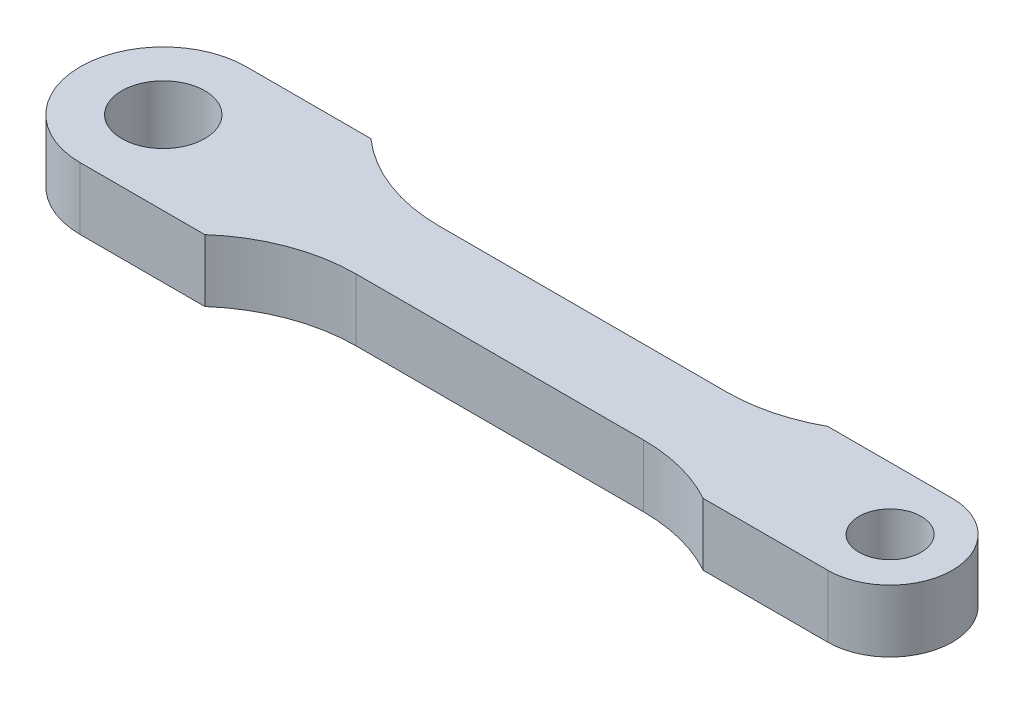
ISO-10303-21;
HEADER;
FILE_DESCRIPTION(('STEP AP214'),'2;1');
FILE_NAME('part.step','',(''),(''),'','','');
FILE_SCHEMA(('AUTOMOTIVE_DESIGN { 1 0 10303 214 1 1 1 1 }'));
ENDSEC;
DATA;
#1=APPLICATION_CONTEXT('core data for automotive mechanical design processes');
#2=APPLICATION_PROTOCOL_DEFINITION('international standard','automotive_design',2000,#1);
#3=PRODUCT_CONTEXT('',#1,'mechanical');
#4=PRODUCT('Part','Part','',(#3));
#5=PRODUCT_RELATED_PRODUCT_CATEGORY('part','',(#4));
#6=PRODUCT_DEFINITION_FORMATION('','',#4);
#7=PRODUCT_DEFINITION_CONTEXT('part definition',#1,'design');
#8=PRODUCT_DEFINITION('design','',#6,#7);
#9=PRODUCT_DEFINITION_SHAPE('','',#8);
#10=(LENGTH_UNIT() NAMED_UNIT(*) SI_UNIT(.MILLI.,.METRE.));
#11=(NAMED_UNIT(*) PLANE_ANGLE_UNIT() SI_UNIT($,.RADIAN.));
#12=(NAMED_UNIT(*) SI_UNIT($,.STERADIAN.) SOLID_ANGLE_UNIT());
#13=UNCERTAINTY_MEASURE_WITH_UNIT(LENGTH_MEASURE(1.E-05),#10,'distance_accuracy_value','');
#14=(GEOMETRIC_REPRESENTATION_CONTEXT(3) GLOBAL_UNCERTAINTY_ASSIGNED_CONTEXT((#13)) GLOBAL_UNIT_ASSIGNED_CONTEXT((#10,
#11,#12)) REPRESENTATION_CONTEXT('',''));
#15=CARTESIAN_POINT('',(0.,0.,0.));
#16=DIRECTION('',(0.,0.,1.));
#17=DIRECTION('',(1.,0.,0.));
#18=AXIS2_PLACEMENT_3D('',#15,#16,#17);
#19=CARTESIAN_POINT('',(0.,3.,-2.00000000000001));
#20=DIRECTION('',(0.,0.,-1.));
#21=DIRECTION('',(-1.,0.,0.));
#22=AXIS2_PLACEMENT_3D('',#19,#20,#21);
#23=PLANE('',#22);
#24=DIRECTION('',(1.,0.,0.));
#25=VECTOR('',#24,1.);
#26=CARTESIAN_POINT('',(0.,0.,-2.00000000000001));
#27=LINE('',#26,#25);
#28=CARTESIAN_POINT('',(11.2915026221292,0.,-2.00000000000001));
#29=VERTEX_POINT('',#28);
#30=CARTESIAN_POINT('',(25.1270166537926,0.,-2.00000000000001));
#31=VERTEX_POINT('',#30);
#32=EDGE_CURVE('E189',#29,#31,#27,.T.);
#33=ORIENTED_EDGE('',*,*,#32,.F.);
#34=DIRECTION('',(0.,-1.,0.));
#35=VECTOR('',#34,1.);
#36=CARTESIAN_POINT('',(11.2915026221292,3.,-2.00000000000001));
#37=LINE('',#36,#35);
#38=CARTESIAN_POINT('',(11.2915026221292,3.,-2.00000000000001));
#39=VERTEX_POINT('',#38);
#40=EDGE_CURVE('E11',#39,#29,#37,.T.);
#41=ORIENTED_EDGE('',*,*,#40,.F.);
#42=DIRECTION('',(1.,0.,0.));
#43=VECTOR('',#42,1.);
#44=CARTESIAN_POINT('',(0.,3.,-2.00000000000001));
#45=LINE('',#44,#43);
#46=CARTESIAN_POINT('',(25.1270166537926,3.,-2.00000000000001));
#47=VERTEX_POINT('',#46);
#48=EDGE_CURVE('E352',#39,#47,#45,.T.);
#49=ORIENTED_EDGE('',*,*,#48,.T.);
#50=DIRECTION('',(0.,-1.,0.));
#51=VECTOR('',#50,1.);
#52=CARTESIAN_POINT('',(25.1270166537926,3.,-2.00000000000001));
#53=LINE('',#52,#51);
#54=EDGE_CURVE('E104',#47,#31,#53,.T.);
#55=ORIENTED_EDGE('',*,*,#54,.T.);
#56=EDGE_LOOP('',(#33,#41,#49,#55));
#57=FACE_BOUND('',#56,.T.);
#58=ADVANCED_FACE('F41',(#57),#23,.T.);
#59=CARTESIAN_POINT('',(11.2915026221292,3.,-10.));
#60=DIRECTION('',(0.,-1.,0.));
#61=DIRECTION('',(0.,0.,-1.));
#62=AXIS2_PLACEMENT_3D('',#59,#60,#61);
#63=CYLINDRICAL_SURFACE('',#62,8.);
#64=CARTESIAN_POINT('',(11.2915026221292,0.,-10.));
#65=DIRECTION('',(0.,1.,0.));
#66=DIRECTION('',(0.,0.,1.));
#67=AXIS2_PLACEMENT_3D('',#64,#65,#66);
#68=CIRCLE('',#67,8.);
#69=CARTESIAN_POINT('',(6.,0.,-4.));
#70=VERTEX_POINT('',#69);
#71=EDGE_CURVE('E187',#29,#70,#68,.F.);
#72=ORIENTED_EDGE('',*,*,#71,.T.);
#73=DIRECTION('',(0.,-1.,0.));
#74=VECTOR('',#73,1.);
#75=CARTESIAN_POINT('',(6.,3.,-4.));
#76=LINE('',#75,#74);
#77=CARTESIAN_POINT('',(6.,3.,-4.));
#78=VERTEX_POINT('',#77);
#79=EDGE_CURVE('E50',#78,#70,#76,.T.);
#80=ORIENTED_EDGE('',*,*,#79,.F.);
#81=CARTESIAN_POINT('',(11.2915026221292,3.,-10.));
#82=DIRECTION('',(0.,1.,0.));
#83=DIRECTION('',(0.,0.,1.));
#84=AXIS2_PLACEMENT_3D('',#81,#82,#83);
#85=CIRCLE('',#84,8.);
#86=EDGE_CURVE('E350',#39,#78,#85,.F.);
#87=ORIENTED_EDGE('',*,*,#86,.F.);
#88=ORIENTED_EDGE('',*,*,#40,.T.);
#89=EDGE_LOOP('',(#72,#80,#87,#88));
#90=FACE_BOUND('',#89,.T.);
#91=ADVANCED_FACE('F188',(#90),#63,.F.);
#92=CARTESIAN_POINT('',(0.,3.,-4.));
#93=DIRECTION('',(0.,0.,-1.));
#94=DIRECTION('',(-1.,0.,0.));
#95=AXIS2_PLACEMENT_3D('',#92,#93,#94);
#96=PLANE('',#95);
#97=DIRECTION('',(1.,0.,0.));
#98=VECTOR('',#97,1.);
#99=CARTESIAN_POINT('',(0.,0.,-4.));
#100=LINE('',#99,#98);
#101=CARTESIAN_POINT('',(0.,0.,-4.));
#102=VERTEX_POINT('',#101);
#103=EDGE_CURVE('E182',#102,#70,#100,.T.);
#104=ORIENTED_EDGE('',*,*,#103,.F.);
#105=DIRECTION('',(0.,-1.,0.));
#106=VECTOR('',#105,1.);
#107=CARTESIAN_POINT('',(0.,3.,-4.));
#108=LINE('',#107,#106);
#109=CARTESIAN_POINT('',(0.,3.,-4.));
#110=VERTEX_POINT('',#109);
#111=EDGE_CURVE('E174',#110,#102,#108,.T.);
#112=ORIENTED_EDGE('',*,*,#111,.F.);
#113=DIRECTION('',(1.,0.,0.));
#114=VECTOR('',#113,1.);
#115=CARTESIAN_POINT('',(0.,3.,-4.));
#116=LINE('',#115,#114);
#117=EDGE_CURVE('E184',#110,#78,#116,.T.);
#118=ORIENTED_EDGE('',*,*,#117,.T.);
#119=ORIENTED_EDGE('',*,*,#79,.T.);
#120=EDGE_LOOP('',(#104,#112,#118,#119));
#121=FACE_BOUND('',#120,.T.);
#122=ADVANCED_FACE('F180',(#121),#96,.T.);
#123=CARTESIAN_POINT('',(0.,3.,0.));
#124=DIRECTION('',(0.,-1.,0.));
#125=DIRECTION('',(0.,0.,-1.));
#126=AXIS2_PLACEMENT_3D('',#123,#124,#125);
#127=CYLINDRICAL_SURFACE('',#126,4.);
#128=CARTESIAN_POINT('',(0.,0.,0.));
#129=DIRECTION('',(0.,1.,0.));
#130=DIRECTION('',(0.,0.,1.));
#131=AXIS2_PLACEMENT_3D('',#128,#129,#130);
#132=CIRCLE('',#131,4.);
#133=CARTESIAN_POINT('',(0.,0.,4.));
#134=VERTEX_POINT('',#133);
#135=EDGE_CURVE('E194',#102,#134,#132,.T.);
#136=ORIENTED_EDGE('',*,*,#135,.T.);
#137=DIRECTION('',(0.,-1.,0.));
#138=VECTOR('',#137,1.);
#139=CARTESIAN_POINT('',(0.,3.,4.));
#140=LINE('',#139,#138);
#141=CARTESIAN_POINT('',(0.,3.,4.));
#142=VERTEX_POINT('',#141);
#143=EDGE_CURVE('E171',#142,#134,#140,.T.);
#144=ORIENTED_EDGE('',*,*,#143,.F.);
#145=CARTESIAN_POINT('',(0.,3.,0.));
#146=DIRECTION('',(0.,1.,0.));
#147=DIRECTION('',(0.,0.,1.));
#148=AXIS2_PLACEMENT_3D('',#145,#146,#147);
#149=CIRCLE('',#148,4.);
#150=EDGE_CURVE('E347',#110,#142,#149,.T.);
#151=ORIENTED_EDGE('',*,*,#150,.F.);
#152=ORIENTED_EDGE('',*,*,#111,.T.);
#153=EDGE_LOOP('',(#136,#144,#151,#152));
#154=FACE_BOUND('',#153,.T.);
#155=ADVANCED_FACE('F281',(#154),#127,.T.);
#156=CARTESIAN_POINT('',(0.,3.,4.));
#157=DIRECTION('',(0.,0.,-1.));
#158=DIRECTION('',(-1.,0.,0.));
#159=AXIS2_PLACEMENT_3D('',#156,#157,#158);
#160=PLANE('',#159);
#161=DIRECTION('',(1.,0.,0.));
#162=VECTOR('',#161,1.);
#163=CARTESIAN_POINT('',(0.,0.,4.));
#164=LINE('',#163,#162);
#165=CARTESIAN_POINT('',(6.,0.,4.));
#166=VERTEX_POINT('',#165);
#167=EDGE_CURVE('E196',#134,#166,#164,.T.);
#168=ORIENTED_EDGE('',*,*,#167,.T.);
#169=DIRECTION('',(0.,-1.,0.));
#170=VECTOR('',#169,1.);
#171=CARTESIAN_POINT('',(6.,3.,4.));
#172=LINE('',#171,#170);
#173=CARTESIAN_POINT('',(6.,3.,4.));
#174=VERTEX_POINT('',#173);
#175=EDGE_CURVE('E169',#174,#166,#172,.T.);
#176=ORIENTED_EDGE('',*,*,#175,.F.);
#177=DIRECTION('',(1.,0.,0.));
#178=VECTOR('',#177,1.);
#179=CARTESIAN_POINT('',(0.,3.,4.));
#180=LINE('',#179,#178);
#181=EDGE_CURVE('E348',#142,#174,#180,.T.);
#182=ORIENTED_EDGE('',*,*,#181,.F.);
#183=ORIENTED_EDGE('',*,*,#143,.T.);
#184=EDGE_LOOP('',(#168,#176,#182,#183));
#185=FACE_BOUND('',#184,.T.);
#186=ADVANCED_FACE('F277',(#185),#160,.F.);
#187=CARTESIAN_POINT('',(11.2915026221292,3.,10.));
#188=DIRECTION('',(0.,-1.,0.));
#189=DIRECTION('',(0.,0.,-1.));
#190=AXIS2_PLACEMENT_3D('',#187,#188,#189);
#191=CYLINDRICAL_SURFACE('',#190,8.);
#192=CARTESIAN_POINT('',(11.2915026221292,0.,10.));
#193=DIRECTION('',(0.,1.,0.));
#194=DIRECTION('',(0.,0.,1.));
#195=AXIS2_PLACEMENT_3D('',#192,#193,#194);
#196=CIRCLE('',#195,8.);
#197=CARTESIAN_POINT('',(11.2915026221292,0.,2.00000000000001));
#198=VERTEX_POINT('',#197);
#199=EDGE_CURVE('E202',#198,#166,#196,.T.);
#200=ORIENTED_EDGE('',*,*,#199,.F.);
#201=DIRECTION('',(0.,-1.,0.));
#202=VECTOR('',#201,1.);
#203=CARTESIAN_POINT('',(11.2915026221292,3.,2.00000000000001));
#204=LINE('',#203,#202);
#205=CARTESIAN_POINT('',(11.2915026221292,3.,2.00000000000001));
#206=VERTEX_POINT('',#205);
#207=EDGE_CURVE('E167',#206,#198,#204,.T.);
#208=ORIENTED_EDGE('',*,*,#207,.F.);
#209=CARTESIAN_POINT('',(11.2915026221292,3.,10.));
#210=DIRECTION('',(0.,1.,0.));
#211=DIRECTION('',(0.,0.,1.));
#212=AXIS2_PLACEMENT_3D('',#209,#210,#211);
#213=CIRCLE('',#212,8.);
#214=EDGE_CURVE('E357',#206,#174,#213,.T.);
#215=ORIENTED_EDGE('',*,*,#214,.T.);
#216=ORIENTED_EDGE('',*,*,#175,.T.);
#217=EDGE_LOOP('',(#200,#208,#215,#216));
#218=FACE_BOUND('',#217,.T.);
#219=ADVANCED_FACE('F273',(#218),#191,.F.);
#220=CARTESIAN_POINT('',(0.,3.,2.00000000000001));
#221=DIRECTION('',(0.,0.,-1.));
#222=DIRECTION('',(-1.,0.,0.));
#223=AXIS2_PLACEMENT_3D('',#220,#221,#222);
#224=PLANE('',#223);
#225=DIRECTION('',(1.,0.,0.));
#226=VECTOR('',#225,1.);
#227=CARTESIAN_POINT('',(0.,0.,2.00000000000001));
#228=LINE('',#227,#226);
#229=CARTESIAN_POINT('',(25.1270166537926,0.,2.00000000000001));
#230=VERTEX_POINT('',#229);
#231=EDGE_CURVE('E205',#198,#230,#228,.T.);
#232=ORIENTED_EDGE('',*,*,#231,.T.);
#233=DIRECTION('',(0.,-1.,0.));
#234=VECTOR('',#233,1.);
#235=CARTESIAN_POINT('',(25.1270166537926,3.,2.00000000000001));
#236=LINE('',#235,#234);
#237=CARTESIAN_POINT('',(25.1270166537926,3.,2.00000000000001));
#238=VERTEX_POINT('',#237);
#239=EDGE_CURVE('E165',#238,#230,#236,.T.);
#240=ORIENTED_EDGE('',*,*,#239,.F.);
#241=DIRECTION('',(1.,0.,0.));
#242=VECTOR('',#241,1.);
#243=CARTESIAN_POINT('',(0.,3.,2.00000000000001));
#244=LINE('',#243,#242);
#245=EDGE_CURVE('E360',#206,#238,#244,.T.);
#246=ORIENTED_EDGE('',*,*,#245,.F.);
#247=ORIENTED_EDGE('',*,*,#207,.T.);
#248=EDGE_LOOP('',(#232,#240,#246,#247));
#249=FACE_BOUND('',#248,.T.);
#250=ADVANCED_FACE('F269',(#249),#224,.F.);
#251=CARTESIAN_POINT('',(25.1270166537926,3.,10.));
#252=DIRECTION('',(0.,-1.,0.));
#253=DIRECTION('',(0.,0.,-1.));
#254=AXIS2_PLACEMENT_3D('',#251,#252,#253);
#255=CYLINDRICAL_SURFACE('',#254,8.);
#256=CARTESIAN_POINT('',(25.1270166537926,0.,10.));
#257=DIRECTION('',(0.,1.,0.));
#258=DIRECTION('',(0.,0.,1.));
#259=AXIS2_PLACEMENT_3D('',#256,#257,#258);
#260=CIRCLE('',#259,8.);
#261=CARTESIAN_POINT('',(29.,0.,3.));
#262=VERTEX_POINT('',#261);
#263=EDGE_CURVE('E208',#262,#230,#260,.T.);
#264=ORIENTED_EDGE('',*,*,#263,.F.);
#265=DIRECTION('',(0.,-1.,0.));
#266=VECTOR('',#265,1.);
#267=CARTESIAN_POINT('',(29.,3.,3.));
#268=LINE('',#267,#266);
#269=CARTESIAN_POINT('',(29.,3.,3.));
#270=VERTEX_POINT('',#269);
#271=EDGE_CURVE('E159',#270,#262,#268,.T.);
#272=ORIENTED_EDGE('',*,*,#271,.F.);
#273=CARTESIAN_POINT('',(25.1270166537926,3.,10.));
#274=DIRECTION('',(0.,1.,0.));
#275=DIRECTION('',(0.,0.,1.));
#276=AXIS2_PLACEMENT_3D('',#273,#274,#275);
#277=CIRCLE('',#276,8.);
#278=EDGE_CURVE('E362',#270,#238,#277,.T.);
#279=ORIENTED_EDGE('',*,*,#278,.T.);
#280=ORIENTED_EDGE('',*,*,#239,.T.);
#281=EDGE_LOOP('',(#264,#272,#279,#280));
#282=FACE_BOUND('',#281,.T.);
#283=ADVANCED_FACE('F265',(#282),#255,.F.);
#284=CARTESIAN_POINT('',(0.,3.,3.));
#285=DIRECTION('',(0.,0.,1.));
#286=DIRECTION('',(1.,0.,0.));
#287=AXIS2_PLACEMENT_3D('',#284,#285,#286);
#288=PLANE('',#287);
#289=DIRECTION('',(-1.,0.,0.));
#290=VECTOR('',#289,1.);
#291=CARTESIAN_POINT('',(0.,0.,3.));
#292=LINE('',#291,#290);
#293=CARTESIAN_POINT('',(35.,0.,3.));
#294=VERTEX_POINT('',#293);
#295=EDGE_CURVE('E211',#294,#262,#292,.T.);
#296=ORIENTED_EDGE('',*,*,#295,.F.);
#297=DIRECTION('',(0.,-1.,0.));
#298=VECTOR('',#297,1.);
#299=CARTESIAN_POINT('',(35.,3.,3.));
#300=LINE('',#299,#298);
#301=CARTESIAN_POINT('',(35.,3.,3.));
#302=VERTEX_POINT('',#301);
#303=EDGE_CURVE('E157',#302,#294,#300,.T.);
#304=ORIENTED_EDGE('',*,*,#303,.F.);
#305=DIRECTION('',(-1.,0.,0.));
#306=VECTOR('',#305,1.);
#307=CARTESIAN_POINT('',(0.,3.,3.));
#308=LINE('',#307,#306);
#309=EDGE_CURVE('E151',#302,#270,#308,.T.);
#310=ORIENTED_EDGE('',*,*,#309,.T.);
#311=ORIENTED_EDGE('',*,*,#271,.T.);
#312=EDGE_LOOP('',(#296,#304,#310,#311));
#313=FACE_BOUND('',#312,.T.);
#314=ADVANCED_FACE('F262',(#313),#288,.T.);
#315=CARTESIAN_POINT('',(35.,3.,0.));
#316=DIRECTION('',(0.,-1.,0.));
#317=DIRECTION('',(0.,0.,-1.));
#318=AXIS2_PLACEMENT_3D('',#315,#316,#317);
#319=CYLINDRICAL_SURFACE('',#318,3.);
#320=CARTESIAN_POINT('',(35.,0.,0.));
#321=DIRECTION('',(0.,1.,0.));
#322=DIRECTION('',(0.,0.,1.));
#323=AXIS2_PLACEMENT_3D('',#320,#321,#322);
#324=CIRCLE('',#323,3.);
#325=CARTESIAN_POINT('',(35.,0.,-3.));
#326=VERTEX_POINT('',#325);
#327=EDGE_CURVE('E156',#294,#326,#324,.T.);
#328=ORIENTED_EDGE('',*,*,#327,.T.);
#329=DIRECTION('',(0.,-1.,0.));
#330=VECTOR('',#329,1.);
#331=CARTESIAN_POINT('',(35.,3.,-3.));
#332=LINE('',#331,#330);
#333=CARTESIAN_POINT('',(35.,3.,-3.));
#334=VERTEX_POINT('',#333);
#335=EDGE_CURVE('E141',#334,#326,#332,.T.);
#336=ORIENTED_EDGE('',*,*,#335,.F.);
#337=CARTESIAN_POINT('',(35.,3.,0.));
#338=DIRECTION('',(0.,1.,0.));
#339=DIRECTION('',(0.,0.,1.));
#340=AXIS2_PLACEMENT_3D('',#337,#338,#339);
#341=CIRCLE('',#340,3.);
#342=EDGE_CURVE('E144',#302,#334,#341,.T.);
#343=ORIENTED_EDGE('',*,*,#342,.F.);
#344=ORIENTED_EDGE('',*,*,#303,.T.);
#345=EDGE_LOOP('',(#328,#336,#343,#344));
#346=FACE_BOUND('',#345,.T.);
#347=ADVANCED_FACE('F154',(#346),#319,.T.);
#348=CARTESIAN_POINT('',(0.,3.,-3.));
#349=DIRECTION('',(0.,0.,1.));
#350=DIRECTION('',(1.,0.,0.));
#351=AXIS2_PLACEMENT_3D('',#348,#349,#350);
#352=PLANE('',#351);
#353=DIRECTION('',(-1.,0.,0.));
#354=VECTOR('',#353,1.);
#355=CARTESIAN_POINT('',(0.,0.,-3.));
#356=LINE('',#355,#354);
#357=CARTESIAN_POINT('',(29.,0.,-3.));
#358=VERTEX_POINT('',#357);
#359=EDGE_CURVE('E215',#326,#358,#356,.T.);
#360=ORIENTED_EDGE('',*,*,#359,.T.);
#361=DIRECTION('',(0.,-1.,0.));
#362=VECTOR('',#361,1.);
#363=CARTESIAN_POINT('',(29.,3.,-3.));
#364=LINE('',#363,#362);
#365=CARTESIAN_POINT('',(29.,3.,-3.));
#366=VERTEX_POINT('',#365);
#367=EDGE_CURVE('E143',#366,#358,#364,.T.);
#368=ORIENTED_EDGE('',*,*,#367,.F.);
#369=DIRECTION('',(-1.,0.,0.));
#370=VECTOR('',#369,1.);
#371=CARTESIAN_POINT('',(0.,3.,-3.));
#372=LINE('',#371,#370);
#373=EDGE_CURVE('E136',#334,#366,#372,.T.);
#374=ORIENTED_EDGE('',*,*,#373,.F.);
#375=ORIENTED_EDGE('',*,*,#335,.T.);
#376=EDGE_LOOP('',(#360,#368,#374,#375));
#377=FACE_BOUND('',#376,.T.);
#378=ADVANCED_FACE('F139',(#377),#352,.F.);
#379=CARTESIAN_POINT('',(0.,3.,0.));
#380=DIRECTION('',(0.,-1.,0.));
#381=DIRECTION('',(0.,0.,-1.));
#382=AXIS2_PLACEMENT_3D('',#379,#380,#381);
#383=CYLINDRICAL_SURFACE('',#382,2.);
#384=CARTESIAN_POINT('',(0.,3.,0.));
#385=DIRECTION('',(0.,1.,0.));
#386=DIRECTION('',(0.,0.,1.));
#387=AXIS2_PLACEMENT_3D('',#384,#385,#386);
#388=CIRCLE('',#387,2.);
#389=CARTESIAN_POINT('',(0.,3.,2.));
#390=VERTEX_POINT('',#389);
#391=EDGE_CURVE('E245',#390,#390,#388,.T.);
#392=ORIENTED_EDGE('',*,*,#391,.T.);
#393=EDGE_LOOP('',(#392));
#394=FACE_BOUND('',#393,.T.);
#395=CARTESIAN_POINT('',(0.,0.,0.));
#396=DIRECTION('',(0.,1.,0.));
#397=DIRECTION('',(0.,0.,1.));
#398=AXIS2_PLACEMENT_3D('',#395,#396,#397);
#399=CIRCLE('',#398,2.);
#400=CARTESIAN_POINT('',(0.,0.,2.));
#401=VERTEX_POINT('',#400);
#402=EDGE_CURVE('E223',#401,#401,#399,.T.);
#403=ORIENTED_EDGE('',*,*,#402,.F.);
#404=EDGE_LOOP('',(#403));
#405=FACE_BOUND('',#404,.T.);
#406=ADVANCED_FACE('F232',(#394,#405),#383,.F.);
#407=CARTESIAN_POINT('',(35.,3.,0.));
#408=DIRECTION('',(0.,-1.,0.));
#409=DIRECTION('',(0.,0.,-1.));
#410=AXIS2_PLACEMENT_3D('',#407,#408,#409);
#411=CYLINDRICAL_SURFACE('',#410,1.5);
#412=CARTESIAN_POINT('',(35.,3.,0.));
#413=DIRECTION('',(0.,1.,0.));
#414=DIRECTION('',(0.,0.,1.));
#415=AXIS2_PLACEMENT_3D('',#412,#413,#414);
#416=CIRCLE('',#415,1.5);
#417=CARTESIAN_POINT('',(35.,3.,1.5));
#418=VERTEX_POINT('',#417);
#419=EDGE_CURVE('E217',#418,#418,#416,.T.);
#420=ORIENTED_EDGE('',*,*,#419,.T.);
#421=EDGE_LOOP('',(#420));
#422=FACE_BOUND('',#421,.T.);
#423=CARTESIAN_POINT('',(35.,0.,0.));
#424=DIRECTION('',(0.,1.,0.));
#425=DIRECTION('',(0.,0.,1.));
#426=AXIS2_PLACEMENT_3D('',#423,#424,#425);
#427=CIRCLE('',#426,1.5);
#428=CARTESIAN_POINT('',(35.,0.,1.5));
#429=VERTEX_POINT('',#428);
#430=EDGE_CURVE('E220',#429,#429,#427,.T.);
#431=ORIENTED_EDGE('',*,*,#430,.F.);
#432=EDGE_LOOP('',(#431));
#433=FACE_BOUND('',#432,.T.);
#434=ADVANCED_FACE('F43',(#422,#433),#411,.F.);
#435=CARTESIAN_POINT('',(25.1270166537926,3.,-10.));
#436=DIRECTION('',(0.,-1.,0.));
#437=DIRECTION('',(0.,0.,-1.));
#438=AXIS2_PLACEMENT_3D('',#435,#436,#437);
#439=CYLINDRICAL_SURFACE('',#438,8.);
#440=CARTESIAN_POINT('',(25.1270166537926,0.,-10.));
#441=DIRECTION('',(0.,1.,0.));
#442=DIRECTION('',(0.,0.,1.));
#443=AXIS2_PLACEMENT_3D('',#440,#441,#442);
#444=CIRCLE('',#443,8.);
#445=EDGE_CURVE('E97',#358,#31,#444,.F.);
#446=ORIENTED_EDGE('',*,*,#445,.T.);
#447=ORIENTED_EDGE('',*,*,#54,.F.);
#448=CARTESIAN_POINT('',(25.1270166537926,3.,-10.));
#449=DIRECTION('',(0.,1.,0.));
#450=DIRECTION('',(0.,0.,1.));
#451=AXIS2_PLACEMENT_3D('',#448,#449,#450);
#452=CIRCLE('',#451,8.);
#453=EDGE_CURVE('E58',#366,#47,#452,.F.);
#454=ORIENTED_EDGE('',*,*,#453,.F.);
#455=ORIENTED_EDGE('',*,*,#367,.T.);
#456=EDGE_LOOP('',(#446,#447,#454,#455));
#457=FACE_BOUND('',#456,.T.);
#458=ADVANCED_FACE('F239',(#457),#439,.F.);
#459=CARTESIAN_POINT('',(0.,3.,0.));
#460=DIRECTION('',(0.,1.,0.));
#461=DIRECTION('',(0.,0.,1.));
#462=AXIS2_PLACEMENT_3D('',#459,#460,#461);
#463=PLANE('',#462);
#464=ORIENTED_EDGE('',*,*,#419,.F.);
#465=EDGE_LOOP('',(#464));
#466=FACE_BOUND('',#465,.T.);
#467=ORIENTED_EDGE('',*,*,#391,.F.);
#468=EDGE_LOOP('',(#467));
#469=FACE_BOUND('',#468,.T.);
#470=ORIENTED_EDGE('',*,*,#48,.F.);
#471=ORIENTED_EDGE('',*,*,#86,.T.);
#472=ORIENTED_EDGE('',*,*,#117,.F.);
#473=ORIENTED_EDGE('',*,*,#150,.T.);
#474=ORIENTED_EDGE('',*,*,#181,.T.);
#475=ORIENTED_EDGE('',*,*,#214,.F.);
#476=ORIENTED_EDGE('',*,*,#245,.T.);
#477=ORIENTED_EDGE('',*,*,#278,.F.);
#478=ORIENTED_EDGE('',*,*,#309,.F.);
#479=ORIENTED_EDGE('',*,*,#342,.T.);
#480=ORIENTED_EDGE('',*,*,#373,.T.);
#481=ORIENTED_EDGE('',*,*,#453,.T.);
#482=EDGE_LOOP('',(#470,#471,#472,#473,#474,#475,#476,#477,#478,#479,#480,#481));
#483=FACE_BOUND('',#482,.T.);
#484=ADVANCED_FACE('F148',(#466,#469,#483),#463,.T.);
#485=CARTESIAN_POINT('',(0.,0.,0.));
#486=DIRECTION('',(0.,1.,0.));
#487=DIRECTION('',(0.,0.,1.));
#488=AXIS2_PLACEMENT_3D('',#485,#486,#487);
#489=PLANE('',#488);
#490=ORIENTED_EDGE('',*,*,#430,.T.);
#491=EDGE_LOOP('',(#490));
#492=FACE_BOUND('',#491,.T.);
#493=ORIENTED_EDGE('',*,*,#402,.T.);
#494=EDGE_LOOP('',(#493));
#495=FACE_BOUND('',#494,.T.);
#496=ORIENTED_EDGE('',*,*,#32,.T.);
#497=ORIENTED_EDGE('',*,*,#445,.F.);
#498=ORIENTED_EDGE('',*,*,#359,.F.);
#499=ORIENTED_EDGE('',*,*,#327,.F.);
#500=ORIENTED_EDGE('',*,*,#295,.T.);
#501=ORIENTED_EDGE('',*,*,#263,.T.);
#502=ORIENTED_EDGE('',*,*,#231,.F.);
#503=ORIENTED_EDGE('',*,*,#199,.T.);
#504=ORIENTED_EDGE('',*,*,#167,.F.);
#505=ORIENTED_EDGE('',*,*,#135,.F.);
#506=ORIENTED_EDGE('',*,*,#103,.T.);
#507=ORIENTED_EDGE('',*,*,#71,.F.);
#508=EDGE_LOOP('',(#496,#497,#498,#499,#500,#501,#502,#503,#504,#505,#506,#507));
#509=FACE_BOUND('',#508,.T.);
#510=ADVANCED_FACE('F192',(#492,#495,#509),#489,.F.);
#511=CLOSED_SHELL('',(#58,#91,#122,#155,#186,#219,#250,#283,#314,#347,#378,#406,#434,#458,#484,#510));
#512=MANIFOLD_SOLID_BREP('B2',#511);
#513=ADVANCED_BREP_SHAPE_REPRESENTATION('',(#18,#512),#14);
#514=SHAPE_DEFINITION_REPRESENTATION(#9,#513);
ENDSEC;
END-ISO-10303-21;
